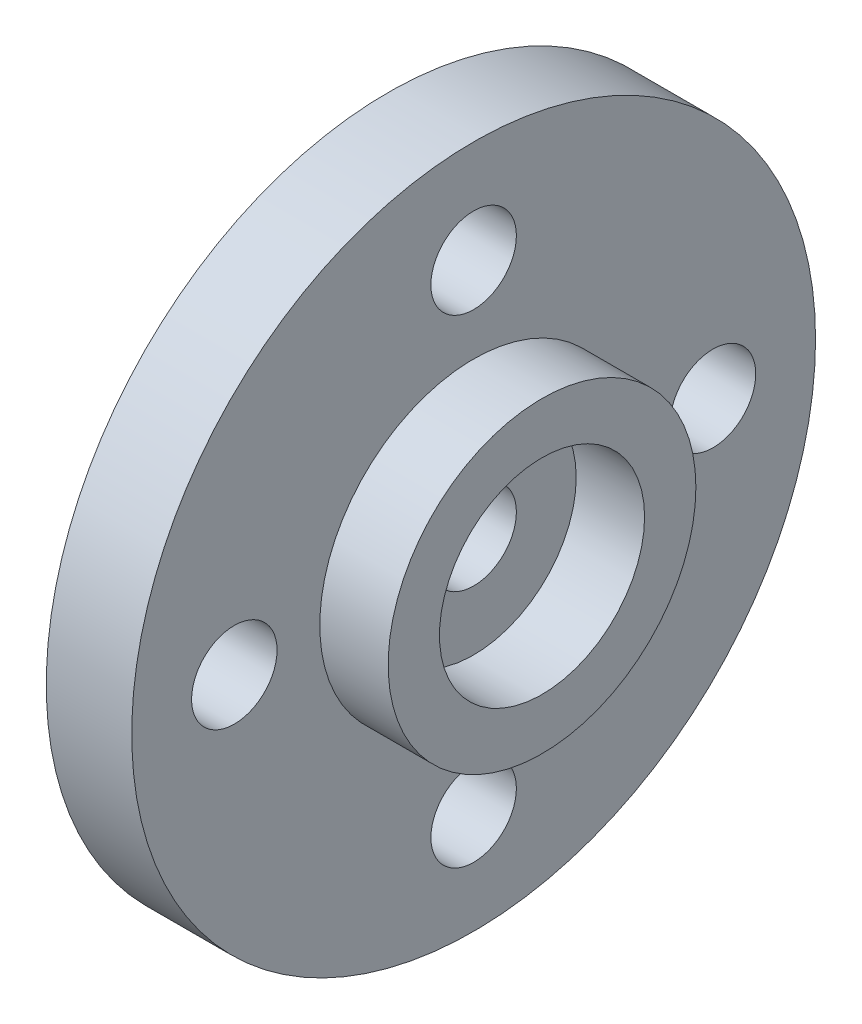
ISO-10303-21;
HEADER;
FILE_DESCRIPTION(('STEP AP214'),'2;1');
FILE_NAME('part.step','',(''),(''),'','','');
FILE_SCHEMA(('AUTOMOTIVE_DESIGN { 1 0 10303 214 1 1 1 1 }'));
ENDSEC;
DATA;
#1=APPLICATION_CONTEXT('core data for automotive mechanical design processes');
#2=APPLICATION_PROTOCOL_DEFINITION('international standard','automotive_design',2000,#1);
#3=PRODUCT_CONTEXT('',#1,'mechanical');
#4=PRODUCT('Part','Part','',(#3));
#5=PRODUCT_RELATED_PRODUCT_CATEGORY('part','',(#4));
#6=PRODUCT_DEFINITION_FORMATION('','',#4);
#7=PRODUCT_DEFINITION_CONTEXT('part definition',#1,'design');
#8=PRODUCT_DEFINITION('design','',#6,#7);
#9=PRODUCT_DEFINITION_SHAPE('','',#8);
#10=(LENGTH_UNIT() NAMED_UNIT(*) SI_UNIT(.MILLI.,.METRE.));
#11=(NAMED_UNIT(*) PLANE_ANGLE_UNIT() SI_UNIT($,.RADIAN.));
#12=(NAMED_UNIT(*) SI_UNIT($,.STERADIAN.) SOLID_ANGLE_UNIT());
#13=UNCERTAINTY_MEASURE_WITH_UNIT(LENGTH_MEASURE(1.E-05),#10,'distance_accuracy_value','');
#14=(GEOMETRIC_REPRESENTATION_CONTEXT(3) GLOBAL_UNCERTAINTY_ASSIGNED_CONTEXT((#13)) GLOBAL_UNIT_ASSIGNED_CONTEXT((#10,
#11,#12)) REPRESENTATION_CONTEXT('',''));
#15=CARTESIAN_POINT('',(0.,0.,0.));
#16=DIRECTION('',(0.,0.,1.));
#17=DIRECTION('',(1.,0.,0.));
#18=AXIS2_PLACEMENT_3D('',#15,#16,#17);
#19=CARTESIAN_POINT('',(2.5,0.,0.));
#20=DIRECTION('',(-1.,0.,0.));
#21=DIRECTION('',(0.,0.,1.));
#22=AXIS2_PLACEMENT_3D('',#19,#20,#21);
#23=CYLINDRICAL_SURFACE('',#22,10.);
#24=CARTESIAN_POINT('',(2.5,0.,0.));
#25=DIRECTION('',(1.,0.,0.));
#26=DIRECTION('',(0.,0.,-1.));
#27=AXIS2_PLACEMENT_3D('',#24,#25,#26);
#28=CIRCLE('',#27,10.);
#29=CARTESIAN_POINT('',(2.5,0.,-10.));
#30=VERTEX_POINT('',#29);
#31=EDGE_CURVE('E48',#30,#30,#28,.T.);
#32=ORIENTED_EDGE('',*,*,#31,.F.);
#33=EDGE_LOOP('',(#32));
#34=FACE_BOUND('',#33,.T.);
#35=CARTESIAN_POINT('',(0.,0.,0.));
#36=DIRECTION('',(1.,0.,0.));
#37=DIRECTION('',(0.,0.,-1.));
#38=AXIS2_PLACEMENT_3D('',#35,#36,#37);
#39=CIRCLE('',#38,10.);
#40=CARTESIAN_POINT('',(0.,0.,-10.));
#41=VERTEX_POINT('',#40);
#42=EDGE_CURVE('E53',#41,#41,#39,.T.);
#43=ORIENTED_EDGE('',*,*,#42,.T.);
#44=EDGE_LOOP('',(#43));
#45=FACE_BOUND('',#44,.T.);
#46=ADVANCED_FACE('F41',(#34,#45),#23,.T.);
#47=CARTESIAN_POINT('',(2.5,0.,0.));
#48=DIRECTION('',(1.,0.,0.));
#49=DIRECTION('',(0.,0.,-1.));
#50=AXIS2_PLACEMENT_3D('',#47,#48,#49);
#51=PLANE('',#50);
#52=CARTESIAN_POINT('',(2.5,7.,0.));
#53=DIRECTION('',(1.,0.,0.));
#54=DIRECTION('',(0.,0.,-1.));
#55=AXIS2_PLACEMENT_3D('',#52,#53,#54);
#56=CIRCLE('',#55,1.25);
#57=CARTESIAN_POINT('',(2.5,7.,-1.25));
#58=VERTEX_POINT('',#57);
#59=EDGE_CURVE('E44',#58,#58,#56,.T.);
#60=ORIENTED_EDGE('',*,*,#59,.F.);
#61=EDGE_LOOP('',(#60));
#62=FACE_BOUND('',#61,.T.);
#63=CARTESIAN_POINT('',(2.5,0.,-7.));
#64=DIRECTION('',(1.,0.,0.));
#65=DIRECTION('',(0.,0.,-1.));
#66=AXIS2_PLACEMENT_3D('',#63,#64,#65);
#67=CIRCLE('',#66,1.25);
#68=CARTESIAN_POINT('',(2.5,0.,-8.25));
#69=VERTEX_POINT('',#68);
#70=EDGE_CURVE('E61',#69,#69,#67,.T.);
#71=ORIENTED_EDGE('',*,*,#70,.F.);
#72=EDGE_LOOP('',(#71));
#73=FACE_BOUND('',#72,.T.);
#74=CARTESIAN_POINT('',(2.5,0.,7.));
#75=DIRECTION('',(1.,0.,0.));
#76=DIRECTION('',(0.,0.,-1.));
#77=AXIS2_PLACEMENT_3D('',#74,#75,#76);
#78=CIRCLE('',#77,1.25);
#79=CARTESIAN_POINT('',(2.5,0.,5.75));
#80=VERTEX_POINT('',#79);
#81=EDGE_CURVE('E68',#80,#80,#78,.T.);
#82=ORIENTED_EDGE('',*,*,#81,.F.);
#83=EDGE_LOOP('',(#82));
#84=FACE_BOUND('',#83,.T.);
#85=CARTESIAN_POINT('',(2.5,-7.,0.));
#86=DIRECTION('',(1.,0.,0.));
#87=DIRECTION('',(0.,0.,-1.));
#88=AXIS2_PLACEMENT_3D('',#85,#86,#87);
#89=CIRCLE('',#88,1.25);
#90=CARTESIAN_POINT('',(2.5,-7.,-1.25));
#91=VERTEX_POINT('',#90);
#92=EDGE_CURVE('E57',#91,#91,#89,.T.);
#93=ORIENTED_EDGE('',*,*,#92,.F.);
#94=EDGE_LOOP('',(#93));
#95=FACE_BOUND('',#94,.T.);
#96=CARTESIAN_POINT('',(2.5,0.,0.));
#97=DIRECTION('',(1.,0.,0.));
#98=DIRECTION('',(0.,0.,-1.));
#99=AXIS2_PLACEMENT_3D('',#96,#97,#98);
#100=CIRCLE('',#99,4.5);
#101=CARTESIAN_POINT('',(2.5,0.,-4.5));
#102=VERTEX_POINT('',#101);
#103=EDGE_CURVE('E85',#102,#102,#100,.T.);
#104=ORIENTED_EDGE('',*,*,#103,.F.);
#105=EDGE_LOOP('',(#104));
#106=FACE_BOUND('',#105,.T.);
#107=ORIENTED_EDGE('',*,*,#31,.T.);
#108=EDGE_LOOP('',(#107));
#109=FACE_BOUND('',#108,.T.);
#110=ADVANCED_FACE('F94',(#62,#73,#84,#95,#106,#109),#51,.T.);
#111=CARTESIAN_POINT('',(0.,0.,0.));
#112=DIRECTION('',(1.,0.,0.));
#113=DIRECTION('',(0.,0.,-1.));
#114=AXIS2_PLACEMENT_3D('',#111,#112,#113);
#115=PLANE('',#114);
#116=CARTESIAN_POINT('',(0.,0.,0.));
#117=DIRECTION('',(-1.,0.,0.));
#118=DIRECTION('',(0.,0.,1.));
#119=AXIS2_PLACEMENT_3D('',#116,#117,#118);
#120=CIRCLE('',#119,1.25);
#121=CARTESIAN_POINT('',(0.,0.,1.25));
#122=VERTEX_POINT('',#121);
#123=EDGE_CURVE('E152',#122,#122,#120,.T.);
#124=ORIENTED_EDGE('',*,*,#123,.F.);
#125=EDGE_LOOP('',(#124));
#126=FACE_BOUND('',#125,.T.);
#127=CARTESIAN_POINT('',(0.,7.,0.));
#128=DIRECTION('',(-1.,0.,0.));
#129=DIRECTION('',(0.,0.,1.));
#130=AXIS2_PLACEMENT_3D('',#127,#128,#129);
#131=CIRCLE('',#130,1.25);
#132=CARTESIAN_POINT('',(0.,7.,1.25));
#133=VERTEX_POINT('',#132);
#134=EDGE_CURVE('E75',#133,#133,#131,.T.);
#135=ORIENTED_EDGE('',*,*,#134,.F.);
#136=EDGE_LOOP('',(#135));
#137=FACE_BOUND('',#136,.T.);
#138=CARTESIAN_POINT('',(0.,0.,-7.));
#139=DIRECTION('',(-1.,0.,0.));
#140=DIRECTION('',(0.,0.,1.));
#141=AXIS2_PLACEMENT_3D('',#138,#139,#140);
#142=CIRCLE('',#141,1.25);
#143=CARTESIAN_POINT('',(0.,0.,-5.75));
#144=VERTEX_POINT('',#143);
#145=EDGE_CURVE('E64',#144,#144,#142,.T.);
#146=ORIENTED_EDGE('',*,*,#145,.F.);
#147=EDGE_LOOP('',(#146));
#148=FACE_BOUND('',#147,.T.);
#149=CARTESIAN_POINT('',(0.,0.,7.));
#150=DIRECTION('',(-1.,0.,0.));
#151=DIRECTION('',(0.,0.,1.));
#152=AXIS2_PLACEMENT_3D('',#149,#150,#151);
#153=CIRCLE('',#152,1.25);
#154=CARTESIAN_POINT('',(0.,0.,8.25));
#155=VERTEX_POINT('',#154);
#156=EDGE_CURVE('E63',#155,#155,#153,.T.);
#157=ORIENTED_EDGE('',*,*,#156,.F.);
#158=EDGE_LOOP('',(#157));
#159=FACE_BOUND('',#158,.T.);
#160=CARTESIAN_POINT('',(0.,-7.,0.));
#161=DIRECTION('',(-1.,0.,0.));
#162=DIRECTION('',(0.,0.,1.));
#163=AXIS2_PLACEMENT_3D('',#160,#161,#162);
#164=CIRCLE('',#163,1.25);
#165=CARTESIAN_POINT('',(0.,-7.,1.25));
#166=VERTEX_POINT('',#165);
#167=EDGE_CURVE('E60',#166,#166,#164,.T.);
#168=ORIENTED_EDGE('',*,*,#167,.F.);
#169=EDGE_LOOP('',(#168));
#170=FACE_BOUND('',#169,.T.);
#171=ORIENTED_EDGE('',*,*,#42,.F.);
#172=EDGE_LOOP('',(#171));
#173=FACE_BOUND('',#172,.T.);
#174=ADVANCED_FACE('F97',(#126,#137,#148,#159,#170,#173),#115,.F.);
#175=CARTESIAN_POINT('',(4.5,0.,0.));
#176=DIRECTION('',(1.,0.,0.));
#177=DIRECTION('',(0.,0.,-1.));
#178=AXIS2_PLACEMENT_3D('',#175,#176,#177);
#179=PLANE('',#178);
#180=CARTESIAN_POINT('',(4.5,0.,0.));
#181=DIRECTION('',(1.,0.,0.));
#182=DIRECTION('',(0.,0.,-1.));
#183=AXIS2_PLACEMENT_3D('',#180,#181,#182);
#184=CIRCLE('',#183,4.5);
#185=CARTESIAN_POINT('',(4.5,0.,-4.5));
#186=VERTEX_POINT('',#185);
#187=EDGE_CURVE('E86',#186,#186,#184,.T.);
#188=ORIENTED_EDGE('',*,*,#187,.T.);
#189=EDGE_LOOP('',(#188));
#190=FACE_BOUND('',#189,.T.);
#191=CARTESIAN_POINT('',(4.5,0.,0.));
#192=DIRECTION('',(1.,0.,0.));
#193=DIRECTION('',(0.,0.,-1.));
#194=AXIS2_PLACEMENT_3D('',#191,#192,#193);
#195=CIRCLE('',#194,3.);
#196=CARTESIAN_POINT('',(4.5,0.,-3.));
#197=VERTEX_POINT('',#196);
#198=EDGE_CURVE('E59',#197,#197,#195,.T.);
#199=ORIENTED_EDGE('',*,*,#198,.F.);
#200=EDGE_LOOP('',(#199));
#201=FACE_BOUND('',#200,.T.);
#202=ADVANCED_FACE('F109',(#190,#201),#179,.T.);
#203=CARTESIAN_POINT('',(4.5,0.,0.));
#204=DIRECTION('',(-1.,0.,0.));
#205=DIRECTION('',(0.,0.,1.));
#206=AXIS2_PLACEMENT_3D('',#203,#204,#205);
#207=CYLINDRICAL_SURFACE('',#206,4.5);
#208=ORIENTED_EDGE('',*,*,#187,.F.);
#209=EDGE_LOOP('',(#208));
#210=FACE_BOUND('',#209,.T.);
#211=ORIENTED_EDGE('',*,*,#103,.T.);
#212=EDGE_LOOP('',(#211));
#213=FACE_BOUND('',#212,.T.);
#214=ADVANCED_FACE('F92',(#210,#213),#207,.T.);
#215=CARTESIAN_POINT('',(4.5,0.,0.));
#216=DIRECTION('',(-1.,0.,0.));
#217=DIRECTION('',(0.,0.,1.));
#218=AXIS2_PLACEMENT_3D('',#215,#216,#217);
#219=CYLINDRICAL_SURFACE('',#218,3.);
#220=ORIENTED_EDGE('',*,*,#198,.T.);
#221=EDGE_LOOP('',(#220));
#222=FACE_BOUND('',#221,.T.);
#223=CARTESIAN_POINT('',(2.5,0.,0.));
#224=DIRECTION('',(1.,0.,0.));
#225=DIRECTION('',(0.,0.,-1.));
#226=AXIS2_PLACEMENT_3D('',#223,#224,#225);
#227=CIRCLE('',#226,3.);
#228=CARTESIAN_POINT('',(2.5,0.,-3.));
#229=VERTEX_POINT('',#228);
#230=EDGE_CURVE('E10',#229,#229,#227,.F.);
#231=ORIENTED_EDGE('',*,*,#230,.T.);
#232=EDGE_LOOP('',(#231));
#233=FACE_BOUND('',#232,.T.);
#234=ADVANCED_FACE('F121',(#222,#233),#219,.F.);
#235=CARTESIAN_POINT('',(2.5,0.,0.));
#236=DIRECTION('',(1.,0.,0.));
#237=DIRECTION('',(0.,0.,-1.));
#238=AXIS2_PLACEMENT_3D('',#235,#236,#237);
#239=CIRCLE('',#238,1.25);
#240=CARTESIAN_POINT('',(2.5,0.,-1.25));
#241=VERTEX_POINT('',#240);
#242=EDGE_CURVE('E150',#241,#241,#239,.T.);
#243=ORIENTED_EDGE('',*,*,#242,.F.);
#244=EDGE_LOOP('',(#243));
#245=FACE_BOUND('',#244,.T.);
#246=ORIENTED_EDGE('',*,*,#230,.F.);
#247=EDGE_LOOP('',(#246));
#248=FACE_BOUND('',#247,.T.);
#249=ADVANCED_FACE('F100',(#245,#248),#51,.T.);
#250=CARTESIAN_POINT('',(0.,-7.,0.));
#251=DIRECTION('',(-1.,0.,0.));
#252=DIRECTION('',(0.,0.,1.));
#253=AXIS2_PLACEMENT_3D('',#250,#251,#252);
#254=CYLINDRICAL_SURFACE('',#253,1.25);
#255=ORIENTED_EDGE('',*,*,#92,.T.);
#256=EDGE_LOOP('',(#255));
#257=FACE_BOUND('',#256,.T.);
#258=ORIENTED_EDGE('',*,*,#167,.T.);
#259=EDGE_LOOP('',(#258));
#260=FACE_BOUND('',#259,.T.);
#261=ADVANCED_FACE('F127',(#257,#260),#254,.F.);
#262=CARTESIAN_POINT('',(0.,0.,7.));
#263=DIRECTION('',(-1.,0.,0.));
#264=DIRECTION('',(0.,0.,1.));
#265=AXIS2_PLACEMENT_3D('',#262,#263,#264);
#266=CYLINDRICAL_SURFACE('',#265,1.25);
#267=ORIENTED_EDGE('',*,*,#81,.T.);
#268=EDGE_LOOP('',(#267));
#269=FACE_BOUND('',#268,.T.);
#270=ORIENTED_EDGE('',*,*,#156,.T.);
#271=EDGE_LOOP('',(#270));
#272=FACE_BOUND('',#271,.T.);
#273=ADVANCED_FACE('F130',(#269,#272),#266,.F.);
#274=CARTESIAN_POINT('',(0.,0.,-7.));
#275=DIRECTION('',(-1.,0.,0.));
#276=DIRECTION('',(0.,0.,1.));
#277=AXIS2_PLACEMENT_3D('',#274,#275,#276);
#278=CYLINDRICAL_SURFACE('',#277,1.25);
#279=ORIENTED_EDGE('',*,*,#70,.T.);
#280=EDGE_LOOP('',(#279));
#281=FACE_BOUND('',#280,.T.);
#282=ORIENTED_EDGE('',*,*,#145,.T.);
#283=EDGE_LOOP('',(#282));
#284=FACE_BOUND('',#283,.T.);
#285=ADVANCED_FACE('F134',(#281,#284),#278,.F.);
#286=CARTESIAN_POINT('',(0.,7.,0.));
#287=DIRECTION('',(-1.,0.,0.));
#288=DIRECTION('',(0.,0.,1.));
#289=AXIS2_PLACEMENT_3D('',#286,#287,#288);
#290=CYLINDRICAL_SURFACE('',#289,1.25);
#291=ORIENTED_EDGE('',*,*,#59,.T.);
#292=EDGE_LOOP('',(#291));
#293=FACE_BOUND('',#292,.T.);
#294=ORIENTED_EDGE('',*,*,#134,.T.);
#295=EDGE_LOOP('',(#294));
#296=FACE_BOUND('',#295,.T.);
#297=ADVANCED_FACE('F138',(#293,#296),#290,.F.);
#298=CARTESIAN_POINT('',(0.,0.,0.));
#299=DIRECTION('',(-1.,0.,0.));
#300=DIRECTION('',(0.,0.,1.));
#301=AXIS2_PLACEMENT_3D('',#298,#299,#300);
#302=CYLINDRICAL_SURFACE('',#301,1.25);
#303=ORIENTED_EDGE('',*,*,#242,.T.);
#304=EDGE_LOOP('',(#303));
#305=FACE_BOUND('',#304,.T.);
#306=ORIENTED_EDGE('',*,*,#123,.T.);
#307=EDGE_LOOP('',(#306));
#308=FACE_BOUND('',#307,.T.);
#309=ADVANCED_FACE('F141',(#305,#308),#302,.F.);
#310=CLOSED_SHELL('',(#46,#110,#174,#202,#214,#234,#249,#261,#273,#285,#297,#309));
#311=MANIFOLD_SOLID_BREP('B2',#310);
#312=ADVANCED_BREP_SHAPE_REPRESENTATION('',(#18,#311),#14);
#313=SHAPE_DEFINITION_REPRESENTATION(#9,#312);
ENDSEC;
END-ISO-10303-21;
